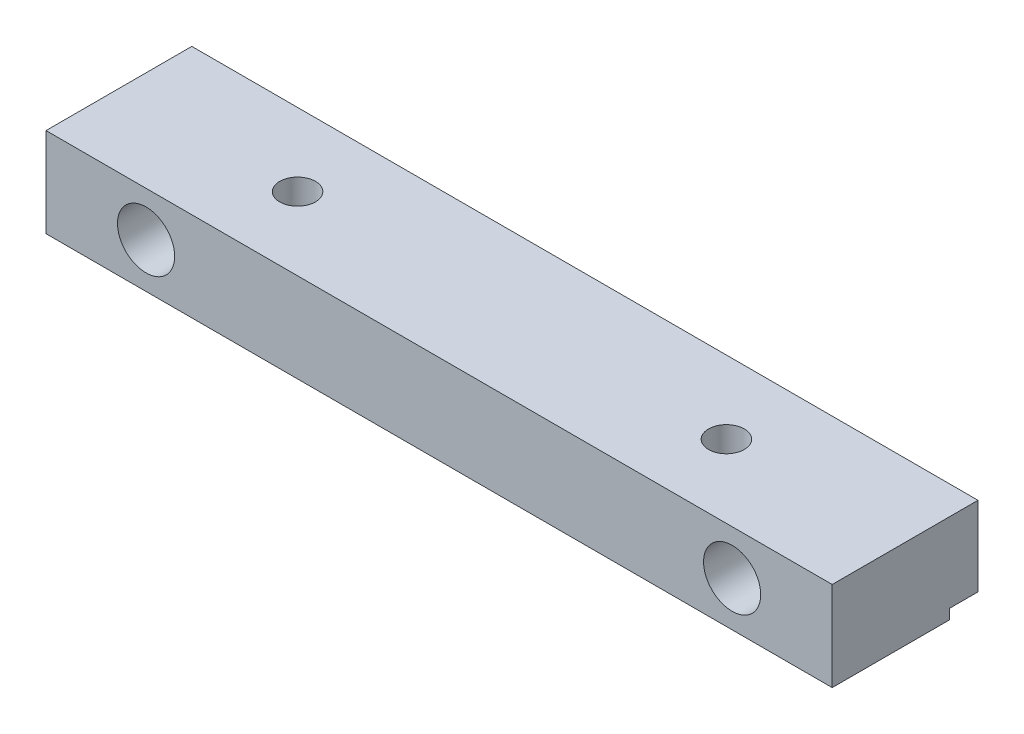
ISO-10303-21;
HEADER;
FILE_DESCRIPTION(('STEP AP214'),'2;1');
FILE_NAME('part.step','',(''),(''),'','','');
FILE_SCHEMA(('AUTOMOTIVE_DESIGN { 1 0 10303 214 1 1 1 1 }'));
ENDSEC;
DATA;
#1=APPLICATION_CONTEXT('core data for automotive mechanical design processes');
#2=APPLICATION_PROTOCOL_DEFINITION('international standard','automotive_design',2000,#1);
#3=PRODUCT_CONTEXT('',#1,'mechanical');
#4=PRODUCT('Part','Part','',(#3));
#5=PRODUCT_RELATED_PRODUCT_CATEGORY('part','',(#4));
#6=PRODUCT_DEFINITION_FORMATION('','',#4);
#7=PRODUCT_DEFINITION_CONTEXT('part definition',#1,'design');
#8=PRODUCT_DEFINITION('design','',#6,#7);
#9=PRODUCT_DEFINITION_SHAPE('','',#8);
#10=(LENGTH_UNIT() NAMED_UNIT(*) SI_UNIT(.MILLI.,.METRE.));
#11=(NAMED_UNIT(*) PLANE_ANGLE_UNIT() SI_UNIT($,.RADIAN.));
#12=(NAMED_UNIT(*) SI_UNIT($,.STERADIAN.) SOLID_ANGLE_UNIT());
#13=UNCERTAINTY_MEASURE_WITH_UNIT(LENGTH_MEASURE(1.E-05),#10,'distance_accuracy_value','');
#14=(GEOMETRIC_REPRESENTATION_CONTEXT(3) GLOBAL_UNCERTAINTY_ASSIGNED_CONTEXT((#13)) GLOBAL_UNIT_ASSIGNED_CONTEXT((#10,
#11,#12)) REPRESENTATION_CONTEXT('',''));
#15=CARTESIAN_POINT('',(0.,0.,0.));
#16=DIRECTION('',(0.,0.,1.));
#17=DIRECTION('',(1.,0.,0.));
#18=AXIS2_PLACEMENT_3D('',#15,#16,#17);
#19=CARTESIAN_POINT('',(0.,6.25,0.));
#20=DIRECTION('',(1.,0.,0.));
#21=DIRECTION('',(0.,0.,-1.));
#22=AXIS2_PLACEMENT_3D('',#19,#20,#21);
#23=PLANE('',#22);
#24=DIRECTION('',(0.,0.,1.));
#25=VECTOR('',#24,1.);
#26=CARTESIAN_POINT('',(0.,0.7,-10.2));
#27=LINE('',#26,#25);
#28=CARTESIAN_POINT('',(0.,0.7,-10.2));
#29=VERTEX_POINT('',#28);
#30=CARTESIAN_POINT('',(0.,0.7,-8.2));
#31=VERTEX_POINT('',#30);
#32=EDGE_CURVE('E100',#29,#31,#27,.T.);
#33=ORIENTED_EDGE('',*,*,#32,.T.);
#34=DIRECTION('',(0.,-1.,0.));
#35=VECTOR('',#34,1.);
#36=CARTESIAN_POINT('',(0.,0.,-8.2));
#37=LINE('',#36,#35);
#38=CARTESIAN_POINT('',(0.,0.,-8.2));
#39=VERTEX_POINT('',#38);
#40=EDGE_CURVE('E111',#31,#39,#37,.T.);
#41=ORIENTED_EDGE('',*,*,#40,.T.);
#42=DIRECTION('',(0.,0.,1.));
#43=VECTOR('',#42,1.);
#44=CARTESIAN_POINT('',(0.,0.,0.));
#45=LINE('',#44,#43);
#46=CARTESIAN_POINT('',(0.,0.,0.));
#47=VERTEX_POINT('',#46);
#48=EDGE_CURVE('E141',#39,#47,#45,.T.);
#49=ORIENTED_EDGE('',*,*,#48,.T.);
#50=DIRECTION('',(0.,-1.,0.));
#51=VECTOR('',#50,1.);
#52=CARTESIAN_POINT('',(0.,6.25,0.));
#53=LINE('',#52,#51);
#54=CARTESIAN_POINT('',(0.,6.25,0.));
#55=VERTEX_POINT('',#54);
#56=EDGE_CURVE('E13',#55,#47,#53,.T.);
#57=ORIENTED_EDGE('',*,*,#56,.F.);
#58=DIRECTION('',(0.,0.,1.));
#59=VECTOR('',#58,1.);
#60=CARTESIAN_POINT('',(0.,6.25,0.));
#61=LINE('',#60,#59);
#62=CARTESIAN_POINT('',(0.,6.25,-10.2));
#63=VERTEX_POINT('',#62);
#64=EDGE_CURVE('E122',#63,#55,#61,.T.);
#65=ORIENTED_EDGE('',*,*,#64,.F.);
#66=DIRECTION('',(0.,-1.,0.));
#67=VECTOR('',#66,1.);
#68=CARTESIAN_POINT('',(0.,6.25,-10.2));
#69=LINE('',#68,#67);
#70=EDGE_CURVE('E116',#63,#29,#69,.T.);
#71=ORIENTED_EDGE('',*,*,#70,.T.);
#72=EDGE_LOOP('',(#33,#41,#49,#57,#65,#71));
#73=FACE_BOUND('',#72,.T.);
#74=ADVANCED_FACE('F42',(#73),#23,.F.);
#75=CARTESIAN_POINT('',(0.,6.25,0.));
#76=DIRECTION('',(0.,0.,-1.));
#77=DIRECTION('',(-1.,0.,0.));
#78=AXIS2_PLACEMENT_3D('',#75,#76,#77);
#79=PLANE('',#78);
#80=CARTESIAN_POINT('',(7.,3.125,0.));
#81=DIRECTION('',(0.,0.,1.));
#82=DIRECTION('',(1.,0.,0.));
#83=AXIS2_PLACEMENT_3D('',#80,#81,#82);
#84=CIRCLE('',#83,2.);
#85=CARTESIAN_POINT('',(9.,3.125,0.));
#86=VERTEX_POINT('',#85);
#87=EDGE_CURVE('E155',#86,#86,#84,.T.);
#88=ORIENTED_EDGE('',*,*,#87,.F.);
#89=EDGE_LOOP('',(#88));
#90=FACE_BOUND('',#89,.T.);
#91=CARTESIAN_POINT('',(48.,3.125,0.));
#92=DIRECTION('',(0.,0.,1.));
#93=DIRECTION('',(1.,0.,0.));
#94=AXIS2_PLACEMENT_3D('',#91,#92,#93);
#95=CIRCLE('',#94,2.);
#96=CARTESIAN_POINT('',(50.,3.125,0.));
#97=VERTEX_POINT('',#96);
#98=EDGE_CURVE('E149',#97,#97,#95,.T.);
#99=ORIENTED_EDGE('',*,*,#98,.F.);
#100=EDGE_LOOP('',(#99));
#101=FACE_BOUND('',#100,.T.);
#102=DIRECTION('',(1.,0.,0.));
#103=VECTOR('',#102,1.);
#104=CARTESIAN_POINT('',(0.,0.,0.));
#105=LINE('',#104,#103);
#106=CARTESIAN_POINT('',(55.,0.,0.));
#107=VERTEX_POINT('',#106);
#108=EDGE_CURVE('E80',#47,#107,#105,.T.);
#109=ORIENTED_EDGE('',*,*,#108,.T.);
#110=DIRECTION('',(0.,-1.,0.));
#111=VECTOR('',#110,1.);
#112=CARTESIAN_POINT('',(55.,6.25,0.));
#113=LINE('',#112,#111);
#114=CARTESIAN_POINT('',(55.,6.25,0.));
#115=VERTEX_POINT('',#114);
#116=EDGE_CURVE('E49',#115,#107,#113,.T.);
#117=ORIENTED_EDGE('',*,*,#116,.F.);
#118=DIRECTION('',(1.,0.,0.));
#119=VECTOR('',#118,1.);
#120=CARTESIAN_POINT('',(0.,6.25,0.));
#121=LINE('',#120,#119);
#122=EDGE_CURVE('E85',#55,#115,#121,.T.);
#123=ORIENTED_EDGE('',*,*,#122,.F.);
#124=ORIENTED_EDGE('',*,*,#56,.T.);
#125=EDGE_LOOP('',(#109,#117,#123,#124));
#126=FACE_BOUND('',#125,.T.);
#127=ADVANCED_FACE('F188',(#90,#101,#126),#79,.F.);
#128=CARTESIAN_POINT('',(55.,6.25,0.));
#129=DIRECTION('',(-1.,0.,0.));
#130=DIRECTION('',(0.,0.,1.));
#131=AXIS2_PLACEMENT_3D('',#128,#129,#130);
#132=PLANE('',#131);
#133=DIRECTION('',(0.,0.,-1.));
#134=VECTOR('',#133,1.);
#135=CARTESIAN_POINT('',(55.,0.,0.));
#136=LINE('',#135,#134);
#137=CARTESIAN_POINT('',(55.,0.,-8.2));
#138=VERTEX_POINT('',#137);
#139=EDGE_CURVE('E128',#107,#138,#136,.T.);
#140=ORIENTED_EDGE('',*,*,#139,.T.);
#141=DIRECTION('',(0.,-1.,0.));
#142=VECTOR('',#141,1.);
#143=CARTESIAN_POINT('',(55.,0.,-8.2));
#144=LINE('',#143,#142);
#145=CARTESIAN_POINT('',(55.,0.7,-8.2));
#146=VERTEX_POINT('',#145);
#147=EDGE_CURVE('E56',#146,#138,#144,.T.);
#148=ORIENTED_EDGE('',*,*,#147,.F.);
#149=DIRECTION('',(0.,0.,1.));
#150=VECTOR('',#149,1.);
#151=CARTESIAN_POINT('',(55.,0.7,-10.2));
#152=LINE('',#151,#150);
#153=CARTESIAN_POINT('',(55.,0.7,-10.2));
#154=VERTEX_POINT('',#153);
#155=EDGE_CURVE('E173',#154,#146,#152,.T.);
#156=ORIENTED_EDGE('',*,*,#155,.F.);
#157=DIRECTION('',(0.,-1.,0.));
#158=VECTOR('',#157,1.);
#159=CARTESIAN_POINT('',(55.,6.25,-10.2));
#160=LINE('',#159,#158);
#161=CARTESIAN_POINT('',(55.,6.25,-10.2));
#162=VERTEX_POINT('',#161);
#163=EDGE_CURVE('E119',#162,#154,#160,.T.);
#164=ORIENTED_EDGE('',*,*,#163,.F.);
#165=DIRECTION('',(0.,0.,-1.));
#166=VECTOR('',#165,1.);
#167=CARTESIAN_POINT('',(55.,6.25,0.));
#168=LINE('',#167,#166);
#169=EDGE_CURVE('E125',#115,#162,#168,.T.);
#170=ORIENTED_EDGE('',*,*,#169,.F.);
#171=ORIENTED_EDGE('',*,*,#116,.T.);
#172=EDGE_LOOP('',(#140,#148,#156,#164,#170,#171));
#173=FACE_BOUND('',#172,.T.);
#174=ADVANCED_FACE('F134',(#173),#132,.F.);
#175=CARTESIAN_POINT('',(0.,6.25,-10.2));
#176=DIRECTION('',(0.,0.,1.));
#177=DIRECTION('',(1.,0.,0.));
#178=AXIS2_PLACEMENT_3D('',#175,#176,#177);
#179=PLANE('',#178);
#180=CARTESIAN_POINT('',(7.,3.125,-10.2));
#181=DIRECTION('',(0.,0.,1.));
#182=DIRECTION('',(1.,0.,0.));
#183=AXIS2_PLACEMENT_3D('',#180,#181,#182);
#184=CIRCLE('',#183,2.);
#185=CARTESIAN_POINT('',(9.,3.125,-10.2));
#186=VERTEX_POINT('',#185);
#187=EDGE_CURVE('E152',#186,#186,#184,.T.);
#188=ORIENTED_EDGE('',*,*,#187,.T.);
#189=EDGE_LOOP('',(#188));
#190=FACE_BOUND('',#189,.T.);
#191=CARTESIAN_POINT('',(48.,3.125,-10.2));
#192=DIRECTION('',(0.,0.,1.));
#193=DIRECTION('',(1.,0.,0.));
#194=AXIS2_PLACEMENT_3D('',#191,#192,#193);
#195=CIRCLE('',#194,1.99999999999999);
#196=CARTESIAN_POINT('',(50.,3.125,-10.2));
#197=VERTEX_POINT('',#196);
#198=EDGE_CURVE('E142',#197,#197,#195,.T.);
#199=ORIENTED_EDGE('',*,*,#198,.T.);
#200=EDGE_LOOP('',(#199));
#201=FACE_BOUND('',#200,.T.);
#202=ORIENTED_EDGE('',*,*,#163,.T.);
#203=DIRECTION('',(1.,0.,0.));
#204=VECTOR('',#203,1.);
#205=CARTESIAN_POINT('',(0.,0.7,-10.2));
#206=LINE('',#205,#204);
#207=EDGE_CURVE('E104',#29,#154,#206,.T.);
#208=ORIENTED_EDGE('',*,*,#207,.F.);
#209=ORIENTED_EDGE('',*,*,#70,.F.);
#210=DIRECTION('',(-1.,0.,0.));
#211=VECTOR('',#210,1.);
#212=CARTESIAN_POINT('',(0.,6.25,-10.2));
#213=LINE('',#212,#211);
#214=EDGE_CURVE('E65',#162,#63,#213,.T.);
#215=ORIENTED_EDGE('',*,*,#214,.F.);
#216=EDGE_LOOP('',(#202,#208,#209,#215));
#217=FACE_BOUND('',#216,.T.);
#218=ADVANCED_FACE('F115',(#190,#201,#217),#179,.F.);
#219=CARTESIAN_POINT('',(0.,6.25,-10.2));
#220=DIRECTION('',(0.,-1.,0.));
#221=DIRECTION('',(0.,0.,-1.));
#222=AXIS2_PLACEMENT_3D('',#219,#220,#221);
#223=PLANE('',#222);
#224=CARTESIAN_POINT('',(12.5,6.25,-5.1));
#225=DIRECTION('',(0.,1.,0.));
#226=DIRECTION('',(0.,0.,1.));
#227=AXIS2_PLACEMENT_3D('',#224,#225,#226);
#228=CIRCLE('',#227,1.24999999999999);
#229=CARTESIAN_POINT('',(12.5,6.25,-3.85000000000001));
#230=VERTEX_POINT('',#229);
#231=EDGE_CURVE('E167',#230,#230,#228,.T.);
#232=ORIENTED_EDGE('',*,*,#231,.F.);
#233=EDGE_LOOP('',(#232));
#234=FACE_BOUND('',#233,.T.);
#235=CARTESIAN_POINT('',(42.5,6.25,-5.1));
#236=DIRECTION('',(0.,1.,0.));
#237=DIRECTION('',(0.,0.,1.));
#238=AXIS2_PLACEMENT_3D('',#235,#236,#237);
#239=CIRCLE('',#238,1.24999999999999);
#240=CARTESIAN_POINT('',(42.5,6.25,-3.85000000000001));
#241=VERTEX_POINT('',#240);
#242=EDGE_CURVE('E161',#241,#241,#239,.T.);
#243=ORIENTED_EDGE('',*,*,#242,.F.);
#244=EDGE_LOOP('',(#243));
#245=FACE_BOUND('',#244,.T.);
#246=ORIENTED_EDGE('',*,*,#64,.T.);
#247=ORIENTED_EDGE('',*,*,#122,.T.);
#248=ORIENTED_EDGE('',*,*,#169,.T.);
#249=ORIENTED_EDGE('',*,*,#214,.T.);
#250=EDGE_LOOP('',(#246,#247,#248,#249));
#251=FACE_BOUND('',#250,.T.);
#252=ADVANCED_FACE('F202',(#234,#245,#251),#223,.F.);
#253=CARTESIAN_POINT('',(0.,0.,-10.2));
#254=DIRECTION('',(0.,-1.,0.));
#255=DIRECTION('',(0.,0.,-1.));
#256=AXIS2_PLACEMENT_3D('',#253,#254,#255);
#257=PLANE('',#256);
#258=DIRECTION('',(1.,0.,0.));
#259=VECTOR('',#258,1.);
#260=CARTESIAN_POINT('',(0.,0.,-8.2));
#261=LINE('',#260,#259);
#262=EDGE_CURVE('E139',#39,#138,#261,.T.);
#263=ORIENTED_EDGE('',*,*,#262,.T.);
#264=ORIENTED_EDGE('',*,*,#139,.F.);
#265=ORIENTED_EDGE('',*,*,#108,.F.);
#266=ORIENTED_EDGE('',*,*,#48,.F.);
#267=EDGE_LOOP('',(#263,#264,#265,#266));
#268=FACE_BOUND('',#267,.T.);
#269=CARTESIAN_POINT('',(12.5,0.,-5.1));
#270=DIRECTION('',(0.,1.,0.));
#271=DIRECTION('',(0.,0.,1.));
#272=AXIS2_PLACEMENT_3D('',#269,#270,#271);
#273=CIRCLE('',#272,1.25);
#274=CARTESIAN_POINT('',(12.5,0.,-3.85));
#275=VERTEX_POINT('',#274);
#276=EDGE_CURVE('E164',#275,#275,#273,.T.);
#277=ORIENTED_EDGE('',*,*,#276,.T.);
#278=EDGE_LOOP('',(#277));
#279=FACE_BOUND('',#278,.T.);
#280=CARTESIAN_POINT('',(42.5,0.,-5.1));
#281=DIRECTION('',(0.,1.,0.));
#282=DIRECTION('',(0.,0.,1.));
#283=AXIS2_PLACEMENT_3D('',#280,#281,#282);
#284=CIRCLE('',#283,1.25);
#285=CARTESIAN_POINT('',(42.5,0.,-3.85));
#286=VERTEX_POINT('',#285);
#287=EDGE_CURVE('E158',#286,#286,#284,.T.);
#288=ORIENTED_EDGE('',*,*,#287,.T.);
#289=EDGE_LOOP('',(#288));
#290=FACE_BOUND('',#289,.T.);
#291=ADVANCED_FACE('F136',(#268,#279,#290),#257,.T.);
#292=CARTESIAN_POINT('',(48.,3.125,0.));
#293=DIRECTION('',(0.,0.,1.));
#294=DIRECTION('',(1.,0.,0.));
#295=AXIS2_PLACEMENT_3D('',#292,#293,#294);
#296=CYLINDRICAL_SURFACE('',#295,2.);
#297=ORIENTED_EDGE('',*,*,#198,.F.);
#298=EDGE_LOOP('',(#297));
#299=FACE_BOUND('',#298,.T.);
#300=ORIENTED_EDGE('',*,*,#98,.T.);
#301=EDGE_LOOP('',(#300));
#302=FACE_BOUND('',#301,.T.);
#303=ADVANCED_FACE('F206',(#299,#302),#296,.F.);
#304=CARTESIAN_POINT('',(7.,3.125,0.));
#305=DIRECTION('',(0.,0.,1.));
#306=DIRECTION('',(1.,0.,0.));
#307=AXIS2_PLACEMENT_3D('',#304,#305,#306);
#308=CYLINDRICAL_SURFACE('',#307,2.);
#309=ORIENTED_EDGE('',*,*,#187,.F.);
#310=EDGE_LOOP('',(#309));
#311=FACE_BOUND('',#310,.T.);
#312=ORIENTED_EDGE('',*,*,#87,.T.);
#313=EDGE_LOOP('',(#312));
#314=FACE_BOUND('',#313,.T.);
#315=ADVANCED_FACE('F212',(#311,#314),#308,.F.);
#316=CARTESIAN_POINT('',(42.5,6.25,-5.1));
#317=DIRECTION('',(0.,1.,0.));
#318=DIRECTION('',(0.,0.,1.));
#319=AXIS2_PLACEMENT_3D('',#316,#317,#318);
#320=CYLINDRICAL_SURFACE('',#319,1.24999999999999);
#321=ORIENTED_EDGE('',*,*,#287,.F.);
#322=EDGE_LOOP('',(#321));
#323=FACE_BOUND('',#322,.T.);
#324=ORIENTED_EDGE('',*,*,#242,.T.);
#325=EDGE_LOOP('',(#324));
#326=FACE_BOUND('',#325,.T.);
#327=ADVANCED_FACE('F184',(#323,#326),#320,.F.);
#328=CARTESIAN_POINT('',(12.5,6.25,-5.1));
#329=DIRECTION('',(0.,1.,0.));
#330=DIRECTION('',(0.,0.,1.));
#331=AXIS2_PLACEMENT_3D('',#328,#329,#330);
#332=CYLINDRICAL_SURFACE('',#331,1.24999999999999);
#333=ORIENTED_EDGE('',*,*,#276,.F.);
#334=EDGE_LOOP('',(#333));
#335=FACE_BOUND('',#334,.T.);
#336=ORIENTED_EDGE('',*,*,#231,.T.);
#337=EDGE_LOOP('',(#336));
#338=FACE_BOUND('',#337,.T.);
#339=ADVANCED_FACE('F177',(#335,#338),#332,.F.);
#340=CARTESIAN_POINT('',(0.,0.,-8.2));
#341=DIRECTION('',(0.,0.,1.));
#342=DIRECTION('',(1.,0.,0.));
#343=AXIS2_PLACEMENT_3D('',#340,#341,#342);
#344=PLANE('',#343);
#345=ORIENTED_EDGE('',*,*,#147,.T.);
#346=ORIENTED_EDGE('',*,*,#262,.F.);
#347=ORIENTED_EDGE('',*,*,#40,.F.);
#348=DIRECTION('',(1.,0.,0.));
#349=VECTOR('',#348,1.);
#350=CARTESIAN_POINT('',(0.,0.7,-8.2));
#351=LINE('',#350,#349);
#352=EDGE_CURVE('E106',#31,#146,#351,.T.);
#353=ORIENTED_EDGE('',*,*,#352,.T.);
#354=EDGE_LOOP('',(#345,#346,#347,#353));
#355=FACE_BOUND('',#354,.T.);
#356=ADVANCED_FACE('F175',(#355),#344,.F.);
#357=CARTESIAN_POINT('',(0.,0.7,-10.2));
#358=DIRECTION('',(0.,1.,0.));
#359=DIRECTION('',(0.,0.,1.));
#360=AXIS2_PLACEMENT_3D('',#357,#358,#359);
#361=PLANE('',#360);
#362=ORIENTED_EDGE('',*,*,#155,.T.);
#363=ORIENTED_EDGE('',*,*,#352,.F.);
#364=ORIENTED_EDGE('',*,*,#32,.F.);
#365=ORIENTED_EDGE('',*,*,#207,.T.);
#366=EDGE_LOOP('',(#362,#363,#364,#365));
#367=FACE_BOUND('',#366,.T.);
#368=ADVANCED_FACE('F103',(#367),#361,.F.);
#369=CLOSED_SHELL('',(#74,#127,#174,#218,#252,#291,#303,#315,#327,#339,#356,#368));
#370=MANIFOLD_SOLID_BREP('B2',#369);
#371=ADVANCED_BREP_SHAPE_REPRESENTATION('',(#18,#370),#14);
#372=SHAPE_DEFINITION_REPRESENTATION(#9,#371);
ENDSEC;
END-ISO-10303-21;
